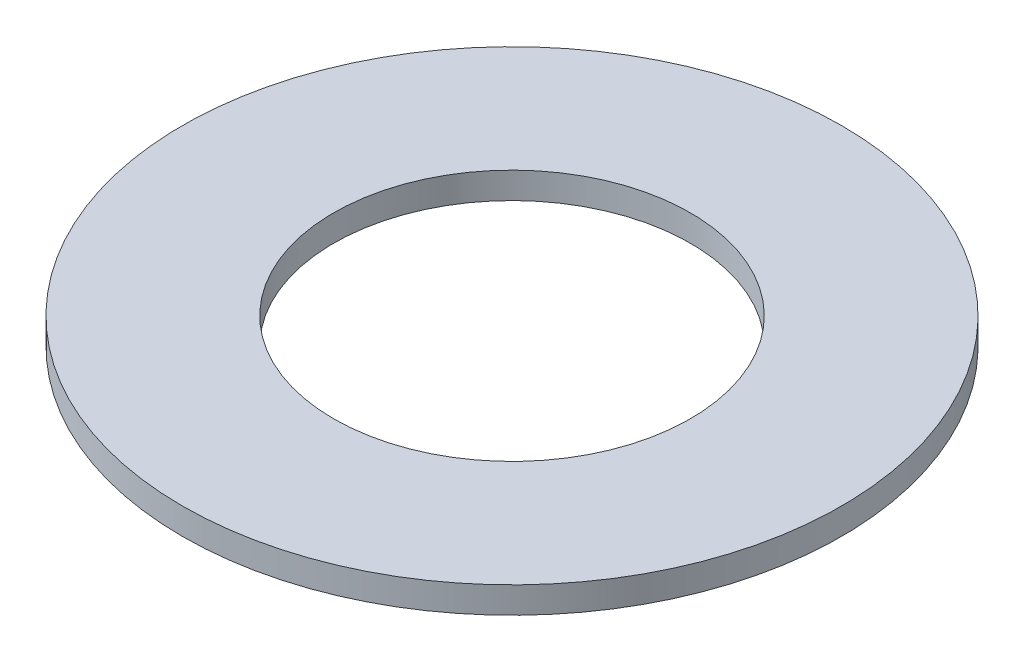
ISO-10303-21;
HEADER;
FILE_DESCRIPTION(('STEP AP214'),'2;1');
FILE_NAME('part.step','',(''),(''),'','','');
FILE_SCHEMA(('AUTOMOTIVE_DESIGN { 1 0 10303 214 1 1 1 1 }'));
ENDSEC;
DATA;
#1=APPLICATION_CONTEXT('core data for automotive mechanical design processes');
#2=APPLICATION_PROTOCOL_DEFINITION('international standard','automotive_design',2000,#1);
#3=PRODUCT_CONTEXT('',#1,'mechanical');
#4=PRODUCT('Part','Part','',(#3));
#5=PRODUCT_RELATED_PRODUCT_CATEGORY('part','',(#4));
#6=PRODUCT_DEFINITION_FORMATION('','',#4);
#7=PRODUCT_DEFINITION_CONTEXT('part definition',#1,'design');
#8=PRODUCT_DEFINITION('design','',#6,#7);
#9=PRODUCT_DEFINITION_SHAPE('','',#8);
#10=(LENGTH_UNIT() NAMED_UNIT(*) SI_UNIT(.MILLI.,.METRE.));
#11=(NAMED_UNIT(*) PLANE_ANGLE_UNIT() SI_UNIT($,.RADIAN.));
#12=(NAMED_UNIT(*) SI_UNIT($,.STERADIAN.) SOLID_ANGLE_UNIT());
#13=UNCERTAINTY_MEASURE_WITH_UNIT(LENGTH_MEASURE(1.E-05),#10,'distance_accuracy_value','');
#14=(GEOMETRIC_REPRESENTATION_CONTEXT(3) GLOBAL_UNCERTAINTY_ASSIGNED_CONTEXT((#13)) GLOBAL_UNIT_ASSIGNED_CONTEXT((#10,
#11,#12)) REPRESENTATION_CONTEXT('',''));
#15=CARTESIAN_POINT('',(0.,0.,0.));
#16=DIRECTION('',(0.,0.,1.));
#17=DIRECTION('',(1.,0.,0.));
#18=AXIS2_PLACEMENT_3D('',#15,#16,#17);
#19=CARTESIAN_POINT('',(0.,1.524,0.));
#20=DIRECTION('',(0.,-1.,0.));
#21=DIRECTION('',(0.,0.,-1.));
#22=AXIS2_PLACEMENT_3D('',#19,#20,#21);
#23=CYLINDRICAL_SURFACE('',#22,19.05);
#24=CARTESIAN_POINT('',(0.,1.524,0.));
#25=DIRECTION('',(0.,1.,0.));
#26=DIRECTION('',(0.,0.,1.));
#27=AXIS2_PLACEMENT_3D('',#24,#25,#26);
#28=CIRCLE('',#27,19.05);
#29=CARTESIAN_POINT('',(0.,1.524,19.05));
#30=VERTEX_POINT('',#29);
#31=EDGE_CURVE('E10',#30,#30,#28,.T.);
#32=ORIENTED_EDGE('',*,*,#31,.F.);
#33=EDGE_LOOP('',(#32));
#34=FACE_BOUND('',#33,.T.);
#35=CARTESIAN_POINT('',(0.,0.,0.));
#36=DIRECTION('',(0.,1.,0.));
#37=DIRECTION('',(0.,0.,1.));
#38=AXIS2_PLACEMENT_3D('',#35,#36,#37);
#39=CIRCLE('',#38,19.05);
#40=CARTESIAN_POINT('',(0.,0.,19.05));
#41=VERTEX_POINT('',#40);
#42=EDGE_CURVE('E37',#41,#41,#39,.T.);
#43=ORIENTED_EDGE('',*,*,#42,.T.);
#44=EDGE_LOOP('',(#43));
#45=FACE_BOUND('',#44,.T.);
#46=ADVANCED_FACE('F34',(#34,#45),#23,.T.);
#47=CARTESIAN_POINT('',(0.,1.524,0.));
#48=DIRECTION('',(0.,1.,0.));
#49=DIRECTION('',(0.,0.,1.));
#50=AXIS2_PLACEMENT_3D('',#47,#48,#49);
#51=PLANE('',#50);
#52=CARTESIAN_POINT('',(0.,1.524,0.));
#53=DIRECTION('',(0.,1.,0.));
#54=DIRECTION('',(0.,0.,1.));
#55=AXIS2_PLACEMENT_3D('',#52,#53,#54);
#56=CIRCLE('',#55,10.3124);
#57=CARTESIAN_POINT('',(0.,1.524,10.3124));
#58=VERTEX_POINT('',#57);
#59=EDGE_CURVE('E46',#58,#58,#56,.T.);
#60=ORIENTED_EDGE('',*,*,#59,.F.);
#61=EDGE_LOOP('',(#60));
#62=FACE_BOUND('',#61,.T.);
#63=ORIENTED_EDGE('',*,*,#31,.T.);
#64=EDGE_LOOP('',(#63));
#65=FACE_BOUND('',#64,.T.);
#66=ADVANCED_FACE('F61',(#62,#65),#51,.T.);
#67=CARTESIAN_POINT('',(0.,0.,0.));
#68=DIRECTION('',(0.,1.,0.));
#69=DIRECTION('',(0.,0.,1.));
#70=AXIS2_PLACEMENT_3D('',#67,#68,#69);
#71=PLANE('',#70);
#72=CARTESIAN_POINT('',(0.,0.,0.));
#73=DIRECTION('',(0.,1.,0.));
#74=DIRECTION('',(0.,0.,1.));
#75=AXIS2_PLACEMENT_3D('',#72,#73,#74);
#76=CIRCLE('',#75,10.3124);
#77=CARTESIAN_POINT('',(0.,0.,10.3124));
#78=VERTEX_POINT('',#77);
#79=EDGE_CURVE('E44',#78,#78,#76,.T.);
#80=ORIENTED_EDGE('',*,*,#79,.T.);
#81=EDGE_LOOP('',(#80));
#82=FACE_BOUND('',#81,.T.);
#83=ORIENTED_EDGE('',*,*,#42,.F.);
#84=EDGE_LOOP('',(#83));
#85=FACE_BOUND('',#84,.T.);
#86=ADVANCED_FACE('F52',(#82,#85),#71,.F.);
#87=CARTESIAN_POINT('',(0.,0.,0.));
#88=DIRECTION('',(0.,1.,0.));
#89=DIRECTION('',(0.,0.,1.));
#90=AXIS2_PLACEMENT_3D('',#87,#88,#89);
#91=CYLINDRICAL_SURFACE('',#90,10.3124);
#92=ORIENTED_EDGE('',*,*,#79,.F.);
#93=EDGE_LOOP('',(#92));
#94=FACE_BOUND('',#93,.T.);
#95=ORIENTED_EDGE('',*,*,#59,.T.);
#96=EDGE_LOOP('',(#95));
#97=FACE_BOUND('',#96,.T.);
#98=ADVANCED_FACE('F55',(#94,#97),#91,.F.);
#99=CLOSED_SHELL('',(#46,#66,#86,#98));
#100=MANIFOLD_SOLID_BREP('B2',#99);
#101=ADVANCED_BREP_SHAPE_REPRESENTATION('',(#18,#100),#14);
#102=SHAPE_DEFINITION_REPRESENTATION(#9,#101);
ENDSEC;
END-ISO-10303-21;
